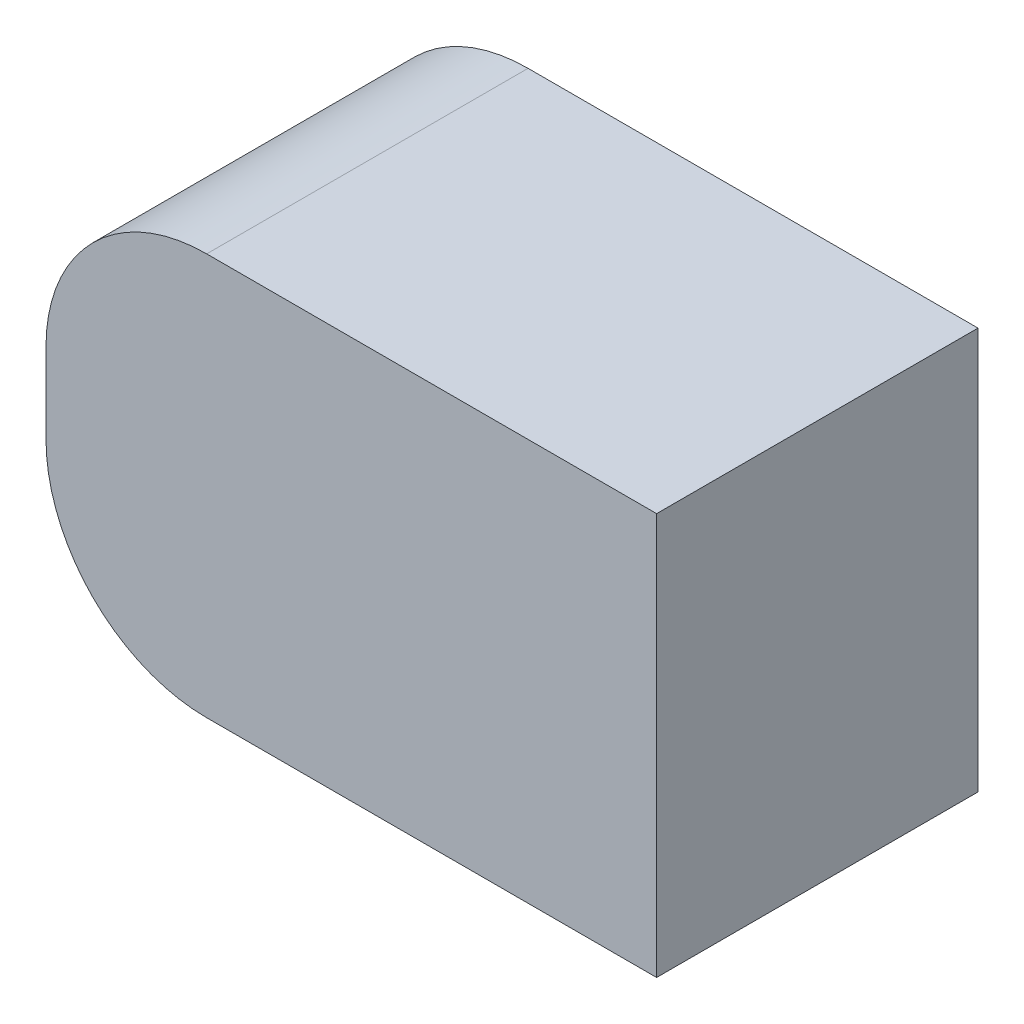
ISO-10303-21;
HEADER;
FILE_DESCRIPTION(('STEP AP214'),'2;1');
FILE_NAME('part.step','',(''),(''),'','','');
FILE_SCHEMA(('AUTOMOTIVE_DESIGN { 1 0 10303 214 1 1 1 1 }'));
ENDSEC;
DATA;
#1=APPLICATION_CONTEXT('core data for automotive mechanical design processes');
#2=APPLICATION_PROTOCOL_DEFINITION('international standard','automotive_design',2000,#1);
#3=PRODUCT_CONTEXT('',#1,'mechanical');
#4=PRODUCT('Part','Part','',(#3));
#5=PRODUCT_RELATED_PRODUCT_CATEGORY('part','',(#4));
#6=PRODUCT_DEFINITION_FORMATION('','',#4);
#7=PRODUCT_DEFINITION_CONTEXT('part definition',#1,'design');
#8=PRODUCT_DEFINITION('design','',#6,#7);
#9=PRODUCT_DEFINITION_SHAPE('','',#8);
#10=(LENGTH_UNIT() NAMED_UNIT(*) SI_UNIT(.MILLI.,.METRE.));
#11=(NAMED_UNIT(*) PLANE_ANGLE_UNIT() SI_UNIT($,.RADIAN.));
#12=(NAMED_UNIT(*) SI_UNIT($,.STERADIAN.) SOLID_ANGLE_UNIT());
#13=UNCERTAINTY_MEASURE_WITH_UNIT(LENGTH_MEASURE(1.E-05),#10,'distance_accuracy_value','');
#14=(GEOMETRIC_REPRESENTATION_CONTEXT(3) GLOBAL_UNCERTAINTY_ASSIGNED_CONTEXT((#13)) GLOBAL_UNIT_ASSIGNED_CONTEXT((#10,
#11,#12)) REPRESENTATION_CONTEXT('',''));
#15=CARTESIAN_POINT('',(0.,0.,0.));
#16=DIRECTION('',(0.,0.,1.));
#17=DIRECTION('',(1.,0.,0.));
#18=AXIS2_PLACEMENT_3D('',#15,#16,#17);
#19=CARTESIAN_POINT('',(1.223,1.025,0.));
#20=DIRECTION('',(0.,0.,-1.));
#21=DIRECTION('',(-0.707106781186548,0.707106781186547,0.));
#22=AXIS2_PLACEMENT_3D('',#19,#20,#21);
#23=CYLINDRICAL_SURFACE('',#22,0.1);
#24=CARTESIAN_POINT('',(1.223,1.025,0.2));
#25=DIRECTION('',(0.,0.,1.));
#26=DIRECTION('',(-0.707106781186548,0.707106781186547,0.));
#27=AXIS2_PLACEMENT_3D('',#24,#25,#26);
#28=CIRCLE('',#27,0.1);
#29=CARTESIAN_POINT('',(1.223,1.125,0.2));
#30=VERTEX_POINT('',#29);
#31=CARTESIAN_POINT('',(1.123,1.025,0.2));
#32=VERTEX_POINT('',#31);
#33=EDGE_CURVE('E11',#30,#32,#28,.T.);
#34=ORIENTED_EDGE('',*,*,#33,.F.);
#35=DIRECTION('',(0.,0.,1.));
#36=VECTOR('',#35,1.);
#37=CARTESIAN_POINT('',(1.223,1.125,0.));
#38=LINE('',#37,#36);
#39=CARTESIAN_POINT('',(1.223,1.125,0.));
#40=VERTEX_POINT('',#39);
#41=EDGE_CURVE('E24',#40,#30,#38,.T.);
#42=ORIENTED_EDGE('',*,*,#41,.F.);
#43=CARTESIAN_POINT('',(1.223,1.025,0.));
#44=DIRECTION('',(0.,0.,-1.));
#45=DIRECTION('',(-0.707106781186548,0.707106781186547,0.));
#46=AXIS2_PLACEMENT_3D('',#43,#44,#45);
#47=CIRCLE('',#46,0.1);
#48=CARTESIAN_POINT('',(1.123,1.025,0.));
#49=VERTEX_POINT('',#48);
#50=EDGE_CURVE('E114',#49,#40,#47,.T.);
#51=ORIENTED_EDGE('',*,*,#50,.F.);
#52=DIRECTION('',(0.,0.,-1.));
#53=VECTOR('',#52,1.);
#54=CARTESIAN_POINT('',(1.123,1.025,0.));
#55=LINE('',#54,#53);
#56=EDGE_CURVE('E111',#32,#49,#55,.T.);
#57=ORIENTED_EDGE('',*,*,#56,.F.);
#58=EDGE_LOOP('',(#34,#42,#51,#57));
#59=FACE_BOUND('',#58,.T.);
#60=ADVANCED_FACE('F17',(#59),#23,.T.);
#61=CARTESIAN_POINT('',(1.313,1.,0.));
#62=DIRECTION('',(0.,0.,-1.));
#63=DIRECTION('',(-1.,0.,0.));
#64=AXIS2_PLACEMENT_3D('',#61,#62,#63);
#65=PLANE('',#64);
#66=ORIENTED_EDGE('',*,*,#50,.T.);
#67=DIRECTION('',(1.,0.,0.));
#68=VECTOR('',#67,1.);
#69=CARTESIAN_POINT('',(1.123,1.125,0.));
#70=LINE('',#69,#68);
#71=CARTESIAN_POINT('',(1.503,1.125,0.));
#72=VERTEX_POINT('',#71);
#73=EDGE_CURVE('E109',#40,#72,#70,.T.);
#74=ORIENTED_EDGE('',*,*,#73,.T.);
#75=DIRECTION('',(0.,-1.,0.));
#76=VECTOR('',#75,1.);
#77=CARTESIAN_POINT('',(1.503,1.125,0.));
#78=LINE('',#77,#76);
#79=CARTESIAN_POINT('',(1.503,0.875,0.));
#80=VERTEX_POINT('',#79);
#81=EDGE_CURVE('E107',#72,#80,#78,.T.);
#82=ORIENTED_EDGE('',*,*,#81,.T.);
#83=DIRECTION('',(-1.,0.,0.));
#84=VECTOR('',#83,1.);
#85=CARTESIAN_POINT('',(1.503,0.875,0.));
#86=LINE('',#85,#84);
#87=CARTESIAN_POINT('',(1.223,0.875000000000014,0.));
#88=VERTEX_POINT('',#87);
#89=EDGE_CURVE('E72',#80,#88,#86,.T.);
#90=ORIENTED_EDGE('',*,*,#89,.T.);
#91=CARTESIAN_POINT('',(1.223,0.975000000000014,0.));
#92=DIRECTION('',(0.,0.,-1.));
#93=DIRECTION('',(-0.707106781186565,-0.70710678118653,0.));
#94=AXIS2_PLACEMENT_3D('',#91,#92,#93);
#95=CIRCLE('',#94,0.1);
#96=CARTESIAN_POINT('',(1.123,0.975000000000014,0.));
#97=VERTEX_POINT('',#96);
#98=EDGE_CURVE('E104',#88,#97,#95,.T.);
#99=ORIENTED_EDGE('',*,*,#98,.T.);
#100=DIRECTION('',(0.,1.,0.));
#101=VECTOR('',#100,1.);
#102=CARTESIAN_POINT('',(1.123,0.875,0.));
#103=LINE('',#102,#101);
#104=EDGE_CURVE('E101',#97,#49,#103,.T.);
#105=ORIENTED_EDGE('',*,*,#104,.T.);
#106=EDGE_LOOP('',(#66,#74,#82,#90,#99,#105));
#107=FACE_BOUND('',#106,.T.);
#108=ADVANCED_FACE('F120',(#107),#65,.T.);
#109=CARTESIAN_POINT('',(1.123,0.875,0.));
#110=DIRECTION('',(1.,0.,0.));
#111=DIRECTION('',(0.,1.,0.));
#112=AXIS2_PLACEMENT_3D('',#109,#110,#111);
#113=PLANE('',#112);
#114=ORIENTED_EDGE('',*,*,#56,.T.);
#115=ORIENTED_EDGE('',*,*,#104,.F.);
#116=DIRECTION('',(0.,0.,1.));
#117=VECTOR('',#116,1.);
#118=CARTESIAN_POINT('',(1.123,0.975000000000014,0.));
#119=LINE('',#118,#117);
#120=CARTESIAN_POINT('',(1.123,0.975000000000014,0.2));
#121=VERTEX_POINT('',#120);
#122=EDGE_CURVE('E99',#97,#121,#119,.T.);
#123=ORIENTED_EDGE('',*,*,#122,.T.);
#124=DIRECTION('',(0.,1.,0.));
#125=VECTOR('',#124,1.);
#126=CARTESIAN_POINT('',(1.123,0.875,0.2));
#127=LINE('',#126,#125);
#128=EDGE_CURVE('E96',#121,#32,#127,.T.);
#129=ORIENTED_EDGE('',*,*,#128,.T.);
#130=EDGE_LOOP('',(#114,#115,#123,#129));
#131=FACE_BOUND('',#130,.T.);
#132=ADVANCED_FACE('F125',(#131),#113,.F.);
#133=CARTESIAN_POINT('',(1.223,0.975000000000014,0.));
#134=DIRECTION('',(0.,0.,-1.));
#135=DIRECTION('',(-0.707106781186565,-0.70710678118653,0.));
#136=AXIS2_PLACEMENT_3D('',#133,#134,#135);
#137=CYLINDRICAL_SURFACE('',#136,0.1);
#138=CARTESIAN_POINT('',(1.223,0.975000000000014,0.2));
#139=DIRECTION('',(0.,0.,1.));
#140=DIRECTION('',(-0.707106781186565,-0.70710678118653,0.));
#141=AXIS2_PLACEMENT_3D('',#138,#139,#140);
#142=CIRCLE('',#141,0.1);
#143=CARTESIAN_POINT('',(1.223,0.875000000000014,0.2));
#144=VERTEX_POINT('',#143);
#145=EDGE_CURVE('E82',#121,#144,#142,.T.);
#146=ORIENTED_EDGE('',*,*,#145,.F.);
#147=ORIENTED_EDGE('',*,*,#122,.F.);
#148=ORIENTED_EDGE('',*,*,#98,.F.);
#149=DIRECTION('',(0.,0.,-1.));
#150=VECTOR('',#149,1.);
#151=CARTESIAN_POINT('',(1.223,0.875000000000014,0.));
#152=LINE('',#151,#150);
#153=EDGE_CURVE('E93',#144,#88,#152,.T.);
#154=ORIENTED_EDGE('',*,*,#153,.F.);
#155=EDGE_LOOP('',(#146,#147,#148,#154));
#156=FACE_BOUND('',#155,.T.);
#157=ADVANCED_FACE('F127',(#156),#137,.T.);
#158=CARTESIAN_POINT('',(1.123,1.125,0.));
#159=DIRECTION('',(0.,-1.,0.));
#160=DIRECTION('',(1.,0.,0.));
#161=AXIS2_PLACEMENT_3D('',#158,#159,#160);
#162=PLANE('',#161);
#163=ORIENTED_EDGE('',*,*,#41,.T.);
#164=DIRECTION('',(1.,0.,0.));
#165=VECTOR('',#164,1.);
#166=CARTESIAN_POINT('',(1.123,1.125,0.2));
#167=LINE('',#166,#165);
#168=CARTESIAN_POINT('',(1.503,1.125,0.2));
#169=VERTEX_POINT('',#168);
#170=EDGE_CURVE('E91',#30,#169,#167,.T.);
#171=ORIENTED_EDGE('',*,*,#170,.T.);
#172=DIRECTION('',(0.,0.,1.));
#173=VECTOR('',#172,1.);
#174=CARTESIAN_POINT('',(1.503,1.125,0.));
#175=LINE('',#174,#173);
#176=EDGE_CURVE('E76',#72,#169,#175,.T.);
#177=ORIENTED_EDGE('',*,*,#176,.F.);
#178=ORIENTED_EDGE('',*,*,#73,.F.);
#179=EDGE_LOOP('',(#163,#171,#177,#178));
#180=FACE_BOUND('',#179,.T.);
#181=ADVANCED_FACE('F118',(#180),#162,.F.);
#182=CARTESIAN_POINT('',(1.503,0.875,0.));
#183=DIRECTION('',(0.,1.,0.));
#184=DIRECTION('',(-1.,0.,0.));
#185=AXIS2_PLACEMENT_3D('',#182,#183,#184);
#186=PLANE('',#185);
#187=ORIENTED_EDGE('',*,*,#153,.T.);
#188=ORIENTED_EDGE('',*,*,#89,.F.);
#189=DIRECTION('',(0.,0.,1.));
#190=VECTOR('',#189,1.);
#191=CARTESIAN_POINT('',(1.503,0.875,0.));
#192=LINE('',#191,#190);
#193=CARTESIAN_POINT('',(1.503,0.875,0.2));
#194=VERTEX_POINT('',#193);
#195=EDGE_CURVE('E67',#80,#194,#192,.T.);
#196=ORIENTED_EDGE('',*,*,#195,.T.);
#197=DIRECTION('',(-1.,0.,0.));
#198=VECTOR('',#197,1.);
#199=CARTESIAN_POINT('',(1.503,0.875,0.2));
#200=LINE('',#199,#198);
#201=EDGE_CURVE('E71',#194,#144,#200,.T.);
#202=ORIENTED_EDGE('',*,*,#201,.T.);
#203=EDGE_LOOP('',(#187,#188,#196,#202));
#204=FACE_BOUND('',#203,.T.);
#205=ADVANCED_FACE('F70',(#204),#186,.F.);
#206=CARTESIAN_POINT('',(1.503,1.125,0.));
#207=DIRECTION('',(-1.,0.,0.));
#208=DIRECTION('',(0.,-1.,0.));
#209=AXIS2_PLACEMENT_3D('',#206,#207,#208);
#210=PLANE('',#209);
#211=ORIENTED_EDGE('',*,*,#81,.F.);
#212=ORIENTED_EDGE('',*,*,#176,.T.);
#213=DIRECTION('',(0.,-1.,0.));
#214=VECTOR('',#213,1.);
#215=CARTESIAN_POINT('',(1.503,1.125,0.2));
#216=LINE('',#215,#214);
#217=EDGE_CURVE('E80',#169,#194,#216,.T.);
#218=ORIENTED_EDGE('',*,*,#217,.T.);
#219=ORIENTED_EDGE('',*,*,#195,.F.);
#220=EDGE_LOOP('',(#211,#212,#218,#219));
#221=FACE_BOUND('',#220,.T.);
#222=ADVANCED_FACE('F86',(#221),#210,.F.);
#223=CARTESIAN_POINT('',(1.313,1.,0.2));
#224=DIRECTION('',(0.,0.,-1.));
#225=DIRECTION('',(-1.,0.,0.));
#226=AXIS2_PLACEMENT_3D('',#223,#224,#225);
#227=PLANE('',#226);
#228=ORIENTED_EDGE('',*,*,#33,.T.);
#229=ORIENTED_EDGE('',*,*,#128,.F.);
#230=ORIENTED_EDGE('',*,*,#145,.T.);
#231=ORIENTED_EDGE('',*,*,#201,.F.);
#232=ORIENTED_EDGE('',*,*,#217,.F.);
#233=ORIENTED_EDGE('',*,*,#170,.F.);
#234=EDGE_LOOP('',(#228,#229,#230,#231,#232,#233));
#235=FACE_BOUND('',#234,.T.);
#236=ADVANCED_FACE('F79',(#235),#227,.F.);
#237=CLOSED_SHELL('',(#60,#108,#132,#157,#181,#205,#222,#236));
#238=MANIFOLD_SOLID_BREP('B1',#237);
#239=ADVANCED_BREP_SHAPE_REPRESENTATION('',(#18,#238),#14);
#240=SHAPE_DEFINITION_REPRESENTATION(#9,#239);
ENDSEC;
END-ISO-10303-21;
